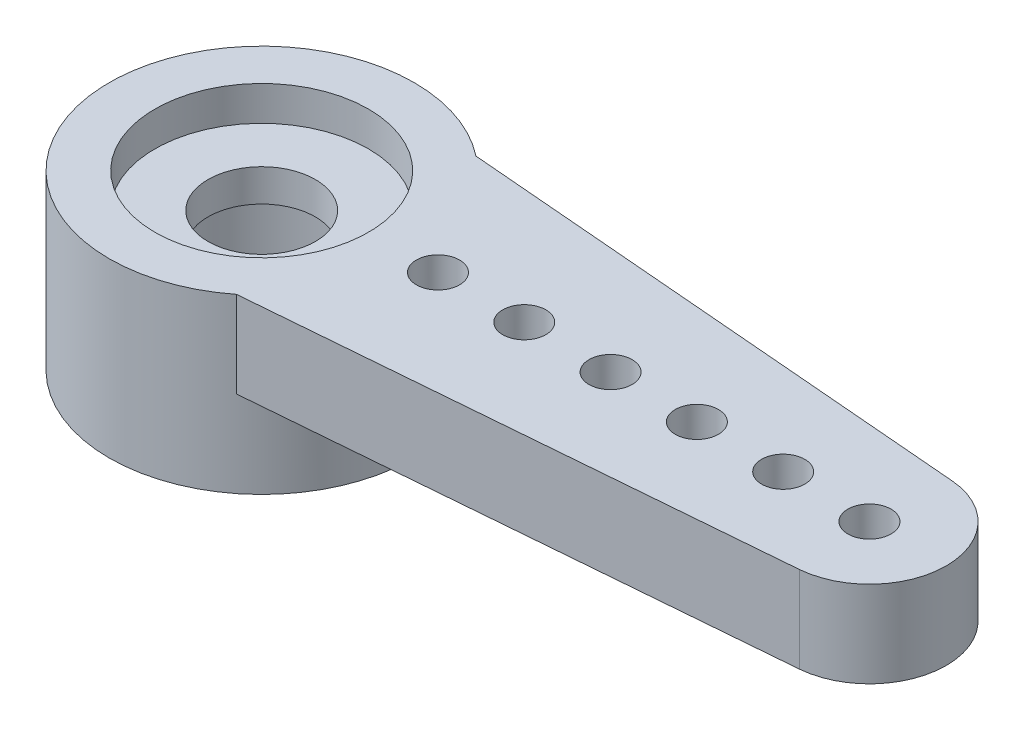
ISO-10303-21;
HEADER;
FILE_DESCRIPTION(('STEP AP214'),'2;1');
FILE_NAME('part.step','',(''),(''),'','','');
FILE_SCHEMA(('AUTOMOTIVE_DESIGN { 1 0 10303 214 1 1 1 1 }'));
ENDSEC;
DATA;
#1=APPLICATION_CONTEXT('core data for automotive mechanical design processes');
#2=APPLICATION_PROTOCOL_DEFINITION('international standard','automotive_design',2000,#1);
#3=PRODUCT_CONTEXT('',#1,'mechanical');
#4=PRODUCT('Part','Part','',(#3));
#5=PRODUCT_RELATED_PRODUCT_CATEGORY('part','',(#4));
#6=PRODUCT_DEFINITION_FORMATION('','',#4);
#7=PRODUCT_DEFINITION_CONTEXT('part definition',#1,'design');
#8=PRODUCT_DEFINITION('design','',#6,#7);
#9=PRODUCT_DEFINITION_SHAPE('','',#8);
#10=(LENGTH_UNIT() NAMED_UNIT(*) SI_UNIT(.MILLI.,.METRE.));
#11=(NAMED_UNIT(*) PLANE_ANGLE_UNIT() SI_UNIT($,.RADIAN.));
#12=(NAMED_UNIT(*) SI_UNIT($,.STERADIAN.) SOLID_ANGLE_UNIT());
#13=UNCERTAINTY_MEASURE_WITH_UNIT(LENGTH_MEASURE(1.E-05),#10,'distance_accuracy_value','');
#14=(GEOMETRIC_REPRESENTATION_CONTEXT(3) GLOBAL_UNCERTAINTY_ASSIGNED_CONTEXT((#13)) GLOBAL_UNIT_ASSIGNED_CONTEXT((#10,
#11,#12)) REPRESENTATION_CONTEXT('',''));
#15=CARTESIAN_POINT('',(0.,0.,0.));
#16=DIRECTION('',(0.,0.,1.));
#17=DIRECTION('',(1.,0.,0.));
#18=AXIS2_PLACEMENT_3D('',#15,#16,#17);
#19=CARTESIAN_POINT('',(0.,55.,0.));
#20=DIRECTION('',(0.,1.,0.));
#21=DIRECTION('',(0.,0.,1.));
#22=AXIS2_PLACEMENT_3D('',#19,#20,#21);
#23=CYLINDRICAL_SURFACE('',#22,3.535);
#24=CARTESIAN_POINT('',(0.,-2.,0.));
#25=DIRECTION('',(0.,1.,0.));
#26=DIRECTION('',(0.,0.,1.));
#27=AXIS2_PLACEMENT_3D('',#24,#25,#26);
#28=CIRCLE('',#27,3.535);
#29=CARTESIAN_POINT('',(0.,-2.,3.535));
#30=VERTEX_POINT('',#29);
#31=EDGE_CURVE('E152',#30,#30,#28,.T.);
#32=ORIENTED_EDGE('',*,*,#31,.T.);
#33=EDGE_LOOP('',(#32));
#34=FACE_BOUND('',#33,.T.);
#35=DIRECTION('',(0.,-1.,0.));
#36=VECTOR('',#35,1.);
#37=CARTESIAN_POINT('',(2.18988584177349,15.9538300204828,-2.775));
#38=LINE('',#37,#36);
#39=CARTESIAN_POINT('',(2.18988584177349,2.,-2.775));
#40=VERTEX_POINT('',#39);
#41=CARTESIAN_POINT('',(2.18988584177349,0.,-2.775));
#42=VERTEX_POINT('',#41);
#43=EDGE_CURVE('E98',#40,#42,#38,.T.);
#44=ORIENTED_EDGE('',*,*,#43,.T.);
#45=CARTESIAN_POINT('',(0.,0.,0.));
#46=DIRECTION('',(0.,1.,0.));
#47=DIRECTION('',(0.,0.,1.));
#48=AXIS2_PLACEMENT_3D('',#45,#46,#47);
#49=CIRCLE('',#48,3.535);
#50=CARTESIAN_POINT('',(2.18988584177349,0.,2.775));
#51=VERTEX_POINT('',#50);
#52=EDGE_CURVE('E103',#51,#42,#49,.T.);
#53=ORIENTED_EDGE('',*,*,#52,.F.);
#54=DIRECTION('',(0.,-1.,0.));
#55=VECTOR('',#54,1.);
#56=CARTESIAN_POINT('',(2.18988584177349,15.9538300204828,2.775));
#57=LINE('',#56,#55);
#58=CARTESIAN_POINT('',(2.18988584177349,2.,2.775));
#59=VERTEX_POINT('',#58);
#60=EDGE_CURVE('E112',#59,#51,#57,.T.);
#61=ORIENTED_EDGE('',*,*,#60,.F.);
#62=CARTESIAN_POINT('',(0.,2.,0.));
#63=DIRECTION('',(0.,1.,0.));
#64=DIRECTION('',(0.,0.,1.));
#65=AXIS2_PLACEMENT_3D('',#62,#63,#64);
#66=CIRCLE('',#65,3.535);
#67=EDGE_CURVE('E58',#40,#59,#66,.T.);
#68=ORIENTED_EDGE('',*,*,#67,.F.);
#69=EDGE_LOOP('',(#44,#53,#61,#68));
#70=FACE_BOUND('',#69,.T.);
#71=ADVANCED_FACE('F38',(#34,#70),#23,.T.);
#72=CARTESIAN_POINT('',(3.535,2.,0.));
#73=DIRECTION('',(0.,-1.,0.));
#74=DIRECTION('',(0.,0.,-1.));
#75=AXIS2_PLACEMENT_3D('',#72,#73,#74);
#76=PLANE('',#75);
#77=DIRECTION('',(-0.996562375684888,0.,-0.0828458289190973));
#78=VECTOR('',#77,1.);
#79=CARTESIAN_POINT('',(0.244137006312476,2.,-2.93675322195096));
#80=LINE('',#79,#78);
#81=CARTESIAN_POINT('',(14.232465575476,2.,-1.7738810287191));
#82=VERTEX_POINT('',#81);
#83=EDGE_CURVE('E97',#82,#40,#80,.T.);
#84=ORIENTED_EDGE('',*,*,#83,.T.);
#85=ORIENTED_EDGE('',*,*,#67,.T.);
#86=DIRECTION('',(-0.996562375684888,0.,0.0828458289190973));
#87=VECTOR('',#86,1.);
#88=CARTESIAN_POINT('',(0.244137006312476,2.,2.93675322195096));
#89=LINE('',#88,#87);
#90=CARTESIAN_POINT('',(14.232465575476,2.,1.7738810287191));
#91=VERTEX_POINT('',#90);
#92=EDGE_CURVE('E53',#91,#59,#89,.T.);
#93=ORIENTED_EDGE('',*,*,#92,.F.);
#94=CARTESIAN_POINT('',(14.085,2.,0.));
#95=DIRECTION('',(0.,-1.,0.));
#96=DIRECTION('',(0.,0.,-1.));
#97=AXIS2_PLACEMENT_3D('',#94,#95,#96);
#98=CIRCLE('',#97,1.78);
#99=EDGE_CURVE('E124',#82,#91,#98,.T.);
#100=ORIENTED_EDGE('',*,*,#99,.F.);
#101=EDGE_LOOP('',(#84,#85,#93,#100));
#102=FACE_BOUND('',#101,.T.);
#103=CARTESIAN_POINT('',(14.085,2.,0.));
#104=DIRECTION('',(0.,-1.,0.));
#105=DIRECTION('',(0.,0.,-1.));
#106=AXIS2_PLACEMENT_3D('',#103,#104,#105);
#107=CIRCLE('',#106,0.500000000000001);
#108=CARTESIAN_POINT('',(14.085,2.,-0.500000000000001));
#109=VERTEX_POINT('',#108);
#110=EDGE_CURVE('E121',#109,#109,#107,.T.);
#111=ORIENTED_EDGE('',*,*,#110,.T.);
#112=EDGE_LOOP('',(#111));
#113=FACE_BOUND('',#112,.T.);
#114=CARTESIAN_POINT('',(12.085,2.,0.));
#115=DIRECTION('',(0.,-1.,0.));
#116=DIRECTION('',(0.,0.,-1.));
#117=AXIS2_PLACEMENT_3D('',#114,#115,#116);
#118=CIRCLE('',#117,0.500000000000001);
#119=CARTESIAN_POINT('',(12.085,2.,-0.499999999999987));
#120=VERTEX_POINT('',#119);
#121=EDGE_CURVE('E118',#120,#120,#118,.T.);
#122=ORIENTED_EDGE('',*,*,#121,.T.);
#123=EDGE_LOOP('',(#122));
#124=FACE_BOUND('',#123,.T.);
#125=CARTESIAN_POINT('',(10.085,2.,0.));
#126=DIRECTION('',(0.,-1.,0.));
#127=DIRECTION('',(0.,0.,-1.));
#128=AXIS2_PLACEMENT_3D('',#125,#126,#127);
#129=CIRCLE('',#128,0.500000000000001);
#130=CARTESIAN_POINT('',(10.085,2.,-0.499999999999973));
#131=VERTEX_POINT('',#130);
#132=EDGE_CURVE('E115',#131,#131,#129,.T.);
#133=ORIENTED_EDGE('',*,*,#132,.T.);
#134=EDGE_LOOP('',(#133));
#135=FACE_BOUND('',#134,.T.);
#136=CARTESIAN_POINT('',(8.085,2.,0.));
#137=DIRECTION('',(0.,-1.,0.));
#138=DIRECTION('',(0.,0.,-1.));
#139=AXIS2_PLACEMENT_3D('',#136,#137,#138);
#140=CIRCLE('',#139,0.500000000000001);
#141=CARTESIAN_POINT('',(8.085,2.,-0.499999999999959));
#142=VERTEX_POINT('',#141);
#143=EDGE_CURVE('E111',#142,#142,#140,.T.);
#144=ORIENTED_EDGE('',*,*,#143,.T.);
#145=EDGE_LOOP('',(#144));
#146=FACE_BOUND('',#145,.T.);
#147=CARTESIAN_POINT('',(6.085,2.,0.));
#148=DIRECTION('',(0.,-1.,0.));
#149=DIRECTION('',(0.,0.,-1.));
#150=AXIS2_PLACEMENT_3D('',#147,#148,#149);
#151=CIRCLE('',#150,0.500000000000001);
#152=CARTESIAN_POINT('',(6.085,2.,-0.499999999999945));
#153=VERTEX_POINT('',#152);
#154=EDGE_CURVE('E108',#153,#153,#151,.T.);
#155=ORIENTED_EDGE('',*,*,#154,.T.);
#156=EDGE_LOOP('',(#155));
#157=FACE_BOUND('',#156,.T.);
#158=CARTESIAN_POINT('',(0.,2.,0.));
#159=DIRECTION('',(0.,1.,0.));
#160=DIRECTION('',(0.,0.,1.));
#161=AXIS2_PLACEMENT_3D('',#158,#159,#160);
#162=CIRCLE('',#161,2.475);
#163=CARTESIAN_POINT('',(0.,2.,2.475));
#164=VERTEX_POINT('',#163);
#165=EDGE_CURVE('E11',#164,#164,#162,.T.);
#166=ORIENTED_EDGE('',*,*,#165,.F.);
#167=EDGE_LOOP('',(#166));
#168=FACE_BOUND('',#167,.T.);
#169=CARTESIAN_POINT('',(4.085,2.,0.));
#170=DIRECTION('',(0.,-1.,0.));
#171=DIRECTION('',(0.,0.,-1.));
#172=AXIS2_PLACEMENT_3D('',#169,#170,#171);
#173=CIRCLE('',#172,0.500000000000001);
#174=CARTESIAN_POINT('',(4.085,2.,-0.499999999999931));
#175=VERTEX_POINT('',#174);
#176=EDGE_CURVE('E127',#175,#175,#173,.T.);
#177=ORIENTED_EDGE('',*,*,#176,.T.);
#178=EDGE_LOOP('',(#177));
#179=FACE_BOUND('',#178,.T.);
#180=ADVANCED_FACE('F40',(#102,#113,#124,#135,#146,#157,#168,#179),#76,.F.);
#181=CARTESIAN_POINT('',(0.,55.,0.));
#182=DIRECTION('',(0.,1.,0.));
#183=DIRECTION('',(0.,0.,1.));
#184=AXIS2_PLACEMENT_3D('',#181,#182,#183);
#185=CYLINDRICAL_SURFACE('',#184,2.475);
#186=CARTESIAN_POINT('',(0.,1.2,0.));
#187=DIRECTION('',(0.,1.,0.));
#188=DIRECTION('',(0.,0.,1.));
#189=AXIS2_PLACEMENT_3D('',#186,#187,#188);
#190=CIRCLE('',#189,2.475);
#191=CARTESIAN_POINT('',(0.,1.2,2.475));
#192=VERTEX_POINT('',#191);
#193=EDGE_CURVE('E46',#192,#192,#190,.T.);
#194=ORIENTED_EDGE('',*,*,#193,.F.);
#195=EDGE_LOOP('',(#194));
#196=FACE_BOUND('',#195,.T.);
#197=ORIENTED_EDGE('',*,*,#165,.T.);
#198=EDGE_LOOP('',(#197));
#199=FACE_BOUND('',#198,.T.);
#200=ADVANCED_FACE('F171',(#196,#199),#185,.F.);
#201=CARTESIAN_POINT('',(2.475,1.2,0.));
#202=DIRECTION('',(0.,-1.,0.));
#203=DIRECTION('',(0.,0.,-1.));
#204=AXIS2_PLACEMENT_3D('',#201,#202,#203);
#205=PLANE('',#204);
#206=CARTESIAN_POINT('',(0.,1.2,0.));
#207=DIRECTION('',(0.,1.,0.));
#208=DIRECTION('',(0.,0.,1.));
#209=AXIS2_PLACEMENT_3D('',#206,#207,#208);
#210=CIRCLE('',#209,1.245);
#211=CARTESIAN_POINT('',(0.,1.2,1.245));
#212=VERTEX_POINT('',#211);
#213=EDGE_CURVE('E164',#212,#212,#210,.T.);
#214=ORIENTED_EDGE('',*,*,#213,.F.);
#215=EDGE_LOOP('',(#214));
#216=FACE_BOUND('',#215,.T.);
#217=ORIENTED_EDGE('',*,*,#193,.T.);
#218=EDGE_LOOP('',(#217));
#219=FACE_BOUND('',#218,.T.);
#220=ADVANCED_FACE('F169',(#216,#219),#205,.F.);
#221=CARTESIAN_POINT('',(0.,55.,0.));
#222=DIRECTION('',(0.,1.,0.));
#223=DIRECTION('',(0.,0.,1.));
#224=AXIS2_PLACEMENT_3D('',#221,#222,#223);
#225=CYLINDRICAL_SURFACE('',#224,1.245);
#226=CARTESIAN_POINT('',(0.,0.449999999999999,0.));
#227=DIRECTION('',(0.,1.,0.));
#228=DIRECTION('',(0.,0.,1.));
#229=AXIS2_PLACEMENT_3D('',#226,#227,#228);
#230=CIRCLE('',#229,1.245);
#231=CARTESIAN_POINT('',(0.,0.449999999999999,1.245));
#232=VERTEX_POINT('',#231);
#233=EDGE_CURVE('E161',#232,#232,#230,.T.);
#234=ORIENTED_EDGE('',*,*,#233,.F.);
#235=EDGE_LOOP('',(#234));
#236=FACE_BOUND('',#235,.T.);
#237=ORIENTED_EDGE('',*,*,#213,.T.);
#238=EDGE_LOOP('',(#237));
#239=FACE_BOUND('',#238,.T.);
#240=ADVANCED_FACE('F209',(#236,#239),#225,.F.);
#241=CARTESIAN_POINT('',(1.245,0.45,0.));
#242=DIRECTION('',(0.,1.,0.));
#243=DIRECTION('',(0.,0.,1.));
#244=AXIS2_PLACEMENT_3D('',#241,#242,#243);
#245=PLANE('',#244);
#246=CARTESIAN_POINT('',(0.,0.449999999999999,0.));
#247=DIRECTION('',(0.,1.,0.));
#248=DIRECTION('',(0.,0.,1.));
#249=AXIS2_PLACEMENT_3D('',#246,#247,#248);
#250=CIRCLE('',#249,2.375);
#251=CARTESIAN_POINT('',(0.,0.449999999999999,2.375));
#252=VERTEX_POINT('',#251);
#253=EDGE_CURVE('E158',#252,#252,#250,.T.);
#254=ORIENTED_EDGE('',*,*,#253,.F.);
#255=EDGE_LOOP('',(#254));
#256=FACE_BOUND('',#255,.T.);
#257=ORIENTED_EDGE('',*,*,#233,.T.);
#258=EDGE_LOOP('',(#257));
#259=FACE_BOUND('',#258,.T.);
#260=ADVANCED_FACE('F205',(#256,#259),#245,.F.);
#261=CARTESIAN_POINT('',(0.,55.,0.));
#262=DIRECTION('',(0.,1.,0.));
#263=DIRECTION('',(0.,0.,1.));
#264=AXIS2_PLACEMENT_3D('',#261,#262,#263);
#265=CYLINDRICAL_SURFACE('',#264,2.375);
#266=CARTESIAN_POINT('',(0.,-2.,0.));
#267=DIRECTION('',(0.,1.,0.));
#268=DIRECTION('',(0.,0.,1.));
#269=AXIS2_PLACEMENT_3D('',#266,#267,#268);
#270=CIRCLE('',#269,2.375);
#271=CARTESIAN_POINT('',(0.,-2.,2.375));
#272=VERTEX_POINT('',#271);
#273=EDGE_CURVE('E155',#272,#272,#270,.T.);
#274=ORIENTED_EDGE('',*,*,#273,.F.);
#275=EDGE_LOOP('',(#274));
#276=FACE_BOUND('',#275,.T.);
#277=ORIENTED_EDGE('',*,*,#253,.T.);
#278=EDGE_LOOP('',(#277));
#279=FACE_BOUND('',#278,.T.);
#280=ADVANCED_FACE('F192',(#276,#279),#265,.F.);
#281=CARTESIAN_POINT('',(2.375,-2.,0.));
#282=DIRECTION('',(0.,1.,0.));
#283=DIRECTION('',(0.,0.,1.));
#284=AXIS2_PLACEMENT_3D('',#281,#282,#283);
#285=PLANE('',#284);
#286=ORIENTED_EDGE('',*,*,#31,.F.);
#287=EDGE_LOOP('',(#286));
#288=FACE_BOUND('',#287,.T.);
#289=ORIENTED_EDGE('',*,*,#273,.T.);
#290=EDGE_LOOP('',(#289));
#291=FACE_BOUND('',#290,.T.);
#292=ADVANCED_FACE('F183',(#288,#291),#285,.F.);
#293=CARTESIAN_POINT('',(4.085,15.9538300204828,0.));
#294=DIRECTION('',(0.,-1.,0.));
#295=DIRECTION('',(0.,0.,-1.));
#296=AXIS2_PLACEMENT_3D('',#293,#294,#295);
#297=CYLINDRICAL_SURFACE('',#296,0.500000000000001);
#298=CARTESIAN_POINT('',(4.085,0.,0.));
#299=DIRECTION('',(0.,1.,0.));
#300=DIRECTION('',(0.,0.,1.));
#301=AXIS2_PLACEMENT_3D('',#298,#299,#300);
#302=CIRCLE('',#301,0.500000000000001);
#303=CARTESIAN_POINT('',(4.085,0.,0.500000000000071));
#304=VERTEX_POINT('',#303);
#305=EDGE_CURVE('E130',#304,#304,#302,.T.);
#306=ORIENTED_EDGE('',*,*,#305,.F.);
#307=EDGE_LOOP('',(#306));
#308=FACE_BOUND('',#307,.T.);
#309=ORIENTED_EDGE('',*,*,#176,.F.);
#310=EDGE_LOOP('',(#309));
#311=FACE_BOUND('',#310,.T.);
#312=ADVANCED_FACE('F180',(#308,#311),#297,.F.);
#313=CARTESIAN_POINT('',(0.244137006312476,15.9538300204828,2.93675322195096));
#314=DIRECTION('',(-0.0828458289190973,0.,-0.996562375684888));
#315=DIRECTION('',(-0.996562375684888,0.,0.0828458289190973));
#316=AXIS2_PLACEMENT_3D('',#313,#314,#315);
#317=PLANE('',#316);
#318=DIRECTION('',(0.,-1.,0.));
#319=VECTOR('',#318,1.);
#320=CARTESIAN_POINT('',(14.232465575476,15.9538300204828,1.7738810287191));
#321=LINE('',#320,#319);
#322=CARTESIAN_POINT('',(14.232465575476,0.,1.7738810287191));
#323=VERTEX_POINT('',#322);
#324=EDGE_CURVE('E83',#91,#323,#321,.T.);
#325=ORIENTED_EDGE('',*,*,#324,.F.);
#326=ORIENTED_EDGE('',*,*,#92,.T.);
#327=ORIENTED_EDGE('',*,*,#60,.T.);
#328=DIRECTION('',(0.996562375684888,0.,-0.0828458289190973));
#329=VECTOR('',#328,1.);
#330=CARTESIAN_POINT('',(0.244137006312476,0.,2.93675322195096));
#331=LINE('',#330,#329);
#332=EDGE_CURVE('E89',#51,#323,#331,.T.);
#333=ORIENTED_EDGE('',*,*,#332,.T.);
#334=EDGE_LOOP('',(#325,#326,#327,#333));
#335=FACE_BOUND('',#334,.T.);
#336=ADVANCED_FACE('F182',(#335),#317,.F.);
#337=CARTESIAN_POINT('',(14.085,15.9538300204828,0.));
#338=DIRECTION('',(0.,-1.,0.));
#339=DIRECTION('',(0.,0.,-1.));
#340=AXIS2_PLACEMENT_3D('',#337,#338,#339);
#341=CYLINDRICAL_SURFACE('',#340,1.78);
#342=CARTESIAN_POINT('',(14.085,0.,0.));
#343=DIRECTION('',(0.,1.,0.));
#344=DIRECTION('',(0.,0.,1.));
#345=AXIS2_PLACEMENT_3D('',#342,#343,#344);
#346=CIRCLE('',#345,1.78);
#347=CARTESIAN_POINT('',(14.232465575476,0.,-1.7738810287191));
#348=VERTEX_POINT('',#347);
#349=EDGE_CURVE('E77',#323,#348,#346,.T.);
#350=ORIENTED_EDGE('',*,*,#349,.T.);
#351=DIRECTION('',(0.,-1.,0.));
#352=VECTOR('',#351,1.);
#353=CARTESIAN_POINT('',(14.232465575476,15.9538300204828,-1.7738810287191));
#354=LINE('',#353,#352);
#355=EDGE_CURVE('E80',#82,#348,#354,.T.);
#356=ORIENTED_EDGE('',*,*,#355,.F.);
#357=ORIENTED_EDGE('',*,*,#99,.T.);
#358=ORIENTED_EDGE('',*,*,#324,.T.);
#359=EDGE_LOOP('',(#350,#356,#357,#358));
#360=FACE_BOUND('',#359,.T.);
#361=ADVANCED_FACE('F79',(#360),#341,.T.);
#362=CARTESIAN_POINT('',(14.085,15.9538300204828,0.));
#363=DIRECTION('',(0.,-1.,0.));
#364=DIRECTION('',(0.,0.,-1.));
#365=AXIS2_PLACEMENT_3D('',#362,#363,#364);
#366=CYLINDRICAL_SURFACE('',#365,0.500000000000001);
#367=CARTESIAN_POINT('',(14.085,0.,0.));
#368=DIRECTION('',(0.,1.,0.));
#369=DIRECTION('',(0.,0.,1.));
#370=AXIS2_PLACEMENT_3D('',#367,#368,#369);
#371=CIRCLE('',#370,0.500000000000001);
#372=CARTESIAN_POINT('',(14.085,0.,0.500000000000001));
#373=VERTEX_POINT('',#372);
#374=EDGE_CURVE('E88',#373,#373,#371,.T.);
#375=ORIENTED_EDGE('',*,*,#374,.F.);
#376=EDGE_LOOP('',(#375));
#377=FACE_BOUND('',#376,.T.);
#378=ORIENTED_EDGE('',*,*,#110,.F.);
#379=EDGE_LOOP('',(#378));
#380=FACE_BOUND('',#379,.T.);
#381=ADVANCED_FACE('F271',(#377,#380),#366,.F.);
#382=CARTESIAN_POINT('',(12.085,15.9538300204828,0.));
#383=DIRECTION('',(0.,-1.,0.));
#384=DIRECTION('',(0.,0.,-1.));
#385=AXIS2_PLACEMENT_3D('',#382,#383,#384);
#386=CYLINDRICAL_SURFACE('',#385,0.500000000000001);
#387=CARTESIAN_POINT('',(12.085,0.,0.));
#388=DIRECTION('',(0.,1.,0.));
#389=DIRECTION('',(0.,0.,1.));
#390=AXIS2_PLACEMENT_3D('',#387,#388,#389);
#391=CIRCLE('',#390,0.500000000000001);
#392=CARTESIAN_POINT('',(12.085,0.,0.500000000000015));
#393=VERTEX_POINT('',#392);
#394=EDGE_CURVE('E137',#393,#393,#391,.T.);
#395=ORIENTED_EDGE('',*,*,#394,.F.);
#396=EDGE_LOOP('',(#395));
#397=FACE_BOUND('',#396,.T.);
#398=ORIENTED_EDGE('',*,*,#121,.F.);
#399=EDGE_LOOP('',(#398));
#400=FACE_BOUND('',#399,.T.);
#401=ADVANCED_FACE('F280',(#397,#400),#386,.F.);
#402=CARTESIAN_POINT('',(10.085,15.9538300204828,0.));
#403=DIRECTION('',(0.,-1.,0.));
#404=DIRECTION('',(0.,0.,-1.));
#405=AXIS2_PLACEMENT_3D('',#402,#403,#404);
#406=CYLINDRICAL_SURFACE('',#405,0.500000000000001);
#407=CARTESIAN_POINT('',(10.085,0.,0.));
#408=DIRECTION('',(0.,1.,0.));
#409=DIRECTION('',(0.,0.,1.));
#410=AXIS2_PLACEMENT_3D('',#407,#408,#409);
#411=CIRCLE('',#410,0.500000000000001);
#412=CARTESIAN_POINT('',(10.085,0.,0.500000000000029));
#413=VERTEX_POINT('',#412);
#414=EDGE_CURVE('E140',#413,#413,#411,.T.);
#415=ORIENTED_EDGE('',*,*,#414,.F.);
#416=EDGE_LOOP('',(#415));
#417=FACE_BOUND('',#416,.T.);
#418=ORIENTED_EDGE('',*,*,#132,.F.);
#419=EDGE_LOOP('',(#418));
#420=FACE_BOUND('',#419,.T.);
#421=ADVANCED_FACE('F291',(#417,#420),#406,.F.);
#422=CARTESIAN_POINT('',(8.085,15.9538300204828,0.));
#423=DIRECTION('',(0.,-1.,0.));
#424=DIRECTION('',(0.,0.,-1.));
#425=AXIS2_PLACEMENT_3D('',#422,#423,#424);
#426=CYLINDRICAL_SURFACE('',#425,0.500000000000001);
#427=CARTESIAN_POINT('',(8.085,0.,0.));
#428=DIRECTION('',(0.,1.,0.));
#429=DIRECTION('',(0.,0.,1.));
#430=AXIS2_PLACEMENT_3D('',#427,#428,#429);
#431=CIRCLE('',#430,0.500000000000001);
#432=CARTESIAN_POINT('',(8.085,0.,0.500000000000043));
#433=VERTEX_POINT('',#432);
#434=EDGE_CURVE('E143',#433,#433,#431,.T.);
#435=ORIENTED_EDGE('',*,*,#434,.F.);
#436=EDGE_LOOP('',(#435));
#437=FACE_BOUND('',#436,.T.);
#438=ORIENTED_EDGE('',*,*,#143,.F.);
#439=EDGE_LOOP('',(#438));
#440=FACE_BOUND('',#439,.T.);
#441=ADVANCED_FACE('F302',(#437,#440),#426,.F.);
#442=CARTESIAN_POINT('',(6.085,15.9538300204828,0.));
#443=DIRECTION('',(0.,-1.,0.));
#444=DIRECTION('',(0.,0.,-1.));
#445=AXIS2_PLACEMENT_3D('',#442,#443,#444);
#446=CYLINDRICAL_SURFACE('',#445,0.500000000000001);
#447=CARTESIAN_POINT('',(6.085,0.,0.));
#448=DIRECTION('',(0.,1.,0.));
#449=DIRECTION('',(0.,0.,1.));
#450=AXIS2_PLACEMENT_3D('',#447,#448,#449);
#451=CIRCLE('',#450,0.500000000000001);
#452=CARTESIAN_POINT('',(6.085,0.,0.500000000000057));
#453=VERTEX_POINT('',#452);
#454=EDGE_CURVE('E146',#453,#453,#451,.T.);
#455=ORIENTED_EDGE('',*,*,#454,.F.);
#456=EDGE_LOOP('',(#455));
#457=FACE_BOUND('',#456,.T.);
#458=ORIENTED_EDGE('',*,*,#154,.F.);
#459=EDGE_LOOP('',(#458));
#460=FACE_BOUND('',#459,.T.);
#461=ADVANCED_FACE('F313',(#457,#460),#446,.F.);
#462=CARTESIAN_POINT('',(0.,0.,0.));
#463=DIRECTION('',(0.,1.,0.));
#464=DIRECTION('',(0.,0.,1.));
#465=AXIS2_PLACEMENT_3D('',#462,#463,#464);
#466=PLANE('',#465);
#467=ORIENTED_EDGE('',*,*,#305,.T.);
#468=EDGE_LOOP('',(#467));
#469=FACE_BOUND('',#468,.T.);
#470=DIRECTION('',(0.996562375684888,0.,0.0828458289190973));
#471=VECTOR('',#470,1.);
#472=CARTESIAN_POINT('',(0.244137006312476,0.,-2.93675322195096));
#473=LINE('',#472,#471);
#474=EDGE_CURVE('E95',#42,#348,#473,.T.);
#475=ORIENTED_EDGE('',*,*,#474,.T.);
#476=ORIENTED_EDGE('',*,*,#349,.F.);
#477=ORIENTED_EDGE('',*,*,#332,.F.);
#478=ORIENTED_EDGE('',*,*,#52,.T.);
#479=EDGE_LOOP('',(#475,#476,#477,#478));
#480=FACE_BOUND('',#479,.T.);
#481=ORIENTED_EDGE('',*,*,#374,.T.);
#482=EDGE_LOOP('',(#481));
#483=FACE_BOUND('',#482,.T.);
#484=ORIENTED_EDGE('',*,*,#394,.T.);
#485=EDGE_LOOP('',(#484));
#486=FACE_BOUND('',#485,.T.);
#487=ORIENTED_EDGE('',*,*,#414,.T.);
#488=EDGE_LOOP('',(#487));
#489=FACE_BOUND('',#488,.T.);
#490=ORIENTED_EDGE('',*,*,#434,.T.);
#491=EDGE_LOOP('',(#490));
#492=FACE_BOUND('',#491,.T.);
#493=ORIENTED_EDGE('',*,*,#454,.T.);
#494=EDGE_LOOP('',(#493));
#495=FACE_BOUND('',#494,.T.);
#496=ADVANCED_FACE('F100',(#469,#480,#483,#486,#489,#492,#495),#466,.F.);
#497=CARTESIAN_POINT('',(0.244137006312476,15.9538300204828,-2.93675322195096));
#498=DIRECTION('',(0.0828458289190973,0.,-0.996562375684888));
#499=DIRECTION('',(-0.996562375684888,0.,-0.0828458289190973));
#500=AXIS2_PLACEMENT_3D('',#497,#498,#499);
#501=PLANE('',#500);
#502=ORIENTED_EDGE('',*,*,#83,.F.);
#503=ORIENTED_EDGE('',*,*,#355,.T.);
#504=ORIENTED_EDGE('',*,*,#474,.F.);
#505=ORIENTED_EDGE('',*,*,#43,.F.);
#506=EDGE_LOOP('',(#502,#503,#504,#505));
#507=FACE_BOUND('',#506,.T.);
#508=ADVANCED_FACE('F93',(#507),#501,.T.);
#509=CLOSED_SHELL('',(#71,#180,#200,#220,#240,#260,#280,#292,#312,#336,#361,#381,#401,#421,#441,
#461,#496,#508));
#510=MANIFOLD_SOLID_BREP('B2',#509);
#511=ADVANCED_BREP_SHAPE_REPRESENTATION('',(#18,#510),#14);
#512=SHAPE_DEFINITION_REPRESENTATION(#9,#511);
ENDSEC;
END-ISO-10303-21;
